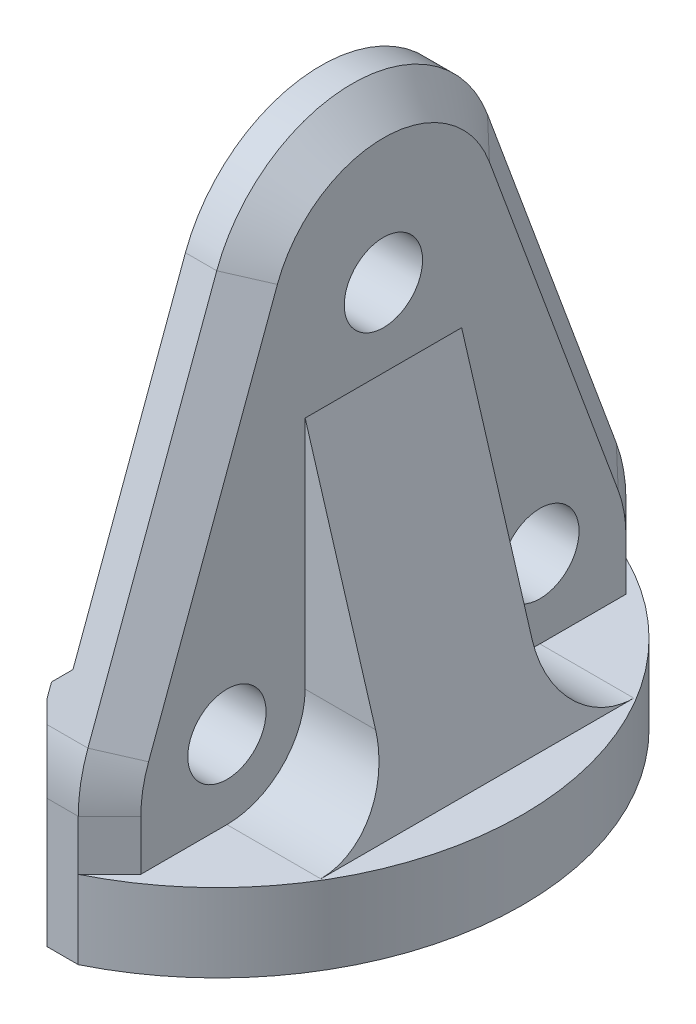
ISO-10303-21;
HEADER;
FILE_DESCRIPTION(('STEP AP214'),'2;1');
FILE_NAME('part.step','',(''),(''),'','','');
FILE_SCHEMA(('AUTOMOTIVE_DESIGN { 1 0 10303 214 1 1 1 1 }'));
ENDSEC;
DATA;
#1=APPLICATION_CONTEXT('core data for automotive mechanical design processes');
#2=APPLICATION_PROTOCOL_DEFINITION('international standard','automotive_design',2000,#1);
#3=PRODUCT_CONTEXT('',#1,'mechanical');
#4=PRODUCT('Part','Part','',(#3));
#5=PRODUCT_RELATED_PRODUCT_CATEGORY('part','',(#4));
#6=PRODUCT_DEFINITION_FORMATION('','',#4);
#7=PRODUCT_DEFINITION_CONTEXT('part definition',#1,'design');
#8=PRODUCT_DEFINITION('design','',#6,#7);
#9=PRODUCT_DEFINITION_SHAPE('','',#8);
#10=(LENGTH_UNIT() NAMED_UNIT(*) SI_UNIT(.MILLI.,.METRE.));
#11=(NAMED_UNIT(*) PLANE_ANGLE_UNIT() SI_UNIT($,.RADIAN.));
#12=(NAMED_UNIT(*) SI_UNIT($,.STERADIAN.) SOLID_ANGLE_UNIT());
#13=UNCERTAINTY_MEASURE_WITH_UNIT(LENGTH_MEASURE(1.E-05),#10,'distance_accuracy_value','');
#14=(GEOMETRIC_REPRESENTATION_CONTEXT(3) GLOBAL_UNCERTAINTY_ASSIGNED_CONTEXT((#13)) GLOBAL_UNIT_ASSIGNED_CONTEXT((#10,
#11,#12)) REPRESENTATION_CONTEXT('',''));
#15=CARTESIAN_POINT('',(0.,0.,0.));
#16=DIRECTION('',(0.,0.,1.));
#17=DIRECTION('',(1.,0.,0.));
#18=AXIS2_PLACEMENT_3D('',#15,#16,#17);
#19=CARTESIAN_POINT('',(4.,30.781,-17.5));
#20=DIRECTION('',(1.,0.,0.));
#21=DIRECTION('',(0.,0.,-1.));
#22=AXIS2_PLACEMENT_3D('',#19,#20,#21);
#23=PLANE('',#22);
#24=CARTESIAN_POINT('',(4.,29.999,-17.5));
#25=DIRECTION('',(1.,0.,0.));
#26=DIRECTION('',(0.,0.,-1.));
#27=AXIS2_PLACEMENT_3D('',#24,#25,#26);
#28=CIRCLE('',#27,2.5);
#29=CARTESIAN_POINT('',(4.,29.999,-20.));
#30=VERTEX_POINT('',#29);
#31=EDGE_CURVE('E269',#30,#30,#28,.T.);
#32=ORIENTED_EDGE('',*,*,#31,.F.);
#33=EDGE_LOOP('',(#32));
#34=FACE_BOUND('',#33,.T.);
#35=CARTESIAN_POINT('',(4.,10.,-7.50000000000001));
#36=DIRECTION('',(1.,0.,0.));
#37=DIRECTION('',(0.,0.,-1.));
#38=AXIS2_PLACEMENT_3D('',#35,#36,#37);
#39=CIRCLE('',#38,2.5);
#40=CARTESIAN_POINT('',(4.,10.,-10.));
#41=VERTEX_POINT('',#40);
#42=EDGE_CURVE('E273',#41,#41,#39,.T.);
#43=ORIENTED_EDGE('',*,*,#42,.F.);
#44=EDGE_LOOP('',(#43));
#45=FACE_BOUND('',#44,.T.);
#46=CARTESIAN_POINT('',(4.,10.,-27.5));
#47=DIRECTION('',(1.,0.,0.));
#48=DIRECTION('',(0.,0.,-1.));
#49=AXIS2_PLACEMENT_3D('',#46,#47,#48);
#50=CIRCLE('',#49,2.5);
#51=CARTESIAN_POINT('',(4.,10.,-30.));
#52=VERTEX_POINT('',#51);
#53=EDGE_CURVE('E279',#52,#52,#50,.T.);
#54=ORIENTED_EDGE('',*,*,#53,.F.);
#55=EDGE_LOOP('',(#54));
#56=FACE_BOUND('',#55,.T.);
#57=DIRECTION('',(0.,0.,-1.));
#58=VECTOR('',#57,1.);
#59=CARTESIAN_POINT('',(4.,5.,-17.5));
#60=LINE('',#59,#58);
#61=CARTESIAN_POINT('',(4.,5.,-2.00000000000001));
#62=VERTEX_POINT('',#61);
#63=CARTESIAN_POINT('',(4.,5.,-7.5));
#64=VERTEX_POINT('',#63);
#65=EDGE_CURVE('E397',#62,#64,#60,.T.);
#66=ORIENTED_EDGE('',*,*,#65,.T.);
#67=CARTESIAN_POINT('',(4.,10.,-7.5));
#68=DIRECTION('',(1.,0.,0.));
#69=DIRECTION('',(0.,0.,-1.));
#70=AXIS2_PLACEMENT_3D('',#67,#68,#69);
#71=CIRCLE('',#70,5.);
#72=CARTESIAN_POINT('',(4.,10.,-12.5));
#73=VERTEX_POINT('',#72);
#74=EDGE_CURVE('E443',#64,#73,#71,.T.);
#75=ORIENTED_EDGE('',*,*,#74,.T.);
#76=DIRECTION('',(0.,1.,0.));
#77=VECTOR('',#76,1.);
#78=CARTESIAN_POINT('',(4.,5.,-12.5));
#79=LINE('',#78,#77);
#80=CARTESIAN_POINT('',(4.,25.,-12.5));
#81=VERTEX_POINT('',#80);
#82=EDGE_CURVE('E253',#73,#81,#79,.T.);
#83=ORIENTED_EDGE('',*,*,#82,.T.);
#84=DIRECTION('',(0.,0.,-1.));
#85=VECTOR('',#84,1.);
#86=CARTESIAN_POINT('',(4.,25.,-12.5));
#87=LINE('',#86,#85);
#88=CARTESIAN_POINT('',(4.,25.,-22.5));
#89=VERTEX_POINT('',#88);
#90=EDGE_CURVE('E259',#81,#89,#87,.T.);
#91=ORIENTED_EDGE('',*,*,#90,.T.);
#92=DIRECTION('',(0.,1.,0.));
#93=VECTOR('',#92,1.);
#94=CARTESIAN_POINT('',(4.,5.,-22.5));
#95=LINE('',#94,#93);
#96=CARTESIAN_POINT('',(4.,10.,-22.5));
#97=VERTEX_POINT('',#96);
#98=EDGE_CURVE('E249',#97,#89,#95,.T.);
#99=ORIENTED_EDGE('',*,*,#98,.F.);
#100=CARTESIAN_POINT('',(4.,10.,-27.5));
#101=DIRECTION('',(1.,0.,0.));
#102=DIRECTION('',(0.,0.,-1.));
#103=AXIS2_PLACEMENT_3D('',#100,#101,#102);
#104=CIRCLE('',#103,5.);
#105=CARTESIAN_POINT('',(4.,5.,-27.5));
#106=VERTEX_POINT('',#105);
#107=EDGE_CURVE('E441',#97,#106,#104,.T.);
#108=ORIENTED_EDGE('',*,*,#107,.T.);
#109=CARTESIAN_POINT('',(4.,5.,-33.));
#110=VERTEX_POINT('',#109);
#111=EDGE_CURVE('E396',#106,#110,#60,.T.);
#112=ORIENTED_EDGE('',*,*,#111,.T.);
#113=DIRECTION('',(0.,-1.,0.));
#114=VECTOR('',#113,1.);
#115=CARTESIAN_POINT('',(4.,0.,-33.));
#116=LINE('',#115,#114);
#117=CARTESIAN_POINT('',(4.,8.213,-33.));
#118=VERTEX_POINT('',#117);
#119=EDGE_CURVE('E332',#110,#118,#116,.F.);
#120=ORIENTED_EDGE('',*,*,#119,.T.);
#121=CARTESIAN_POINT('',(4.,8.213,-25.));
#122=DIRECTION('',(1.,0.,0.));
#123=DIRECTION('',(0.,0.,-1.));
#124=AXIS2_PLACEMENT_3D('',#121,#122,#123);
#125=CIRCLE('',#124,7.99999999999999);
#126=CARTESIAN_POINT('',(4.,10.9832832619337,-32.5050336873761));
#127=VERTEX_POINT('',#126);
#128=EDGE_CURVE('E334',#118,#127,#125,.T.);
#129=ORIENTED_EDGE('',*,*,#128,.T.);
#130=DIRECTION('',(0.,-0.93812921092201,-0.346285407741717));
#131=VECTOR('',#130,1.);
#132=CARTESIAN_POINT('',(4.,10.9832832619337,-32.5050336873761));
#133=LINE('',#132,#131);
#134=CARTESIAN_POINT('',(4.,33.2815269293029,-24.2742310320678));
#135=VERTEX_POINT('',#134);
#136=EDGE_CURVE('E313',#127,#135,#133,.F.);
#137=ORIENTED_EDGE('',*,*,#136,.T.);
#138=CARTESIAN_POINT('',(4.,30.781,-17.5));
#139=DIRECTION('',(1.,0.,0.));
#140=DIRECTION('',(0.,0.,-1.));
#141=AXIS2_PLACEMENT_3D('',#138,#139,#140);
#142=CIRCLE('',#141,7.221);
#143=CARTESIAN_POINT('',(4.,33.2812308832856,-10.7256596977813));
#144=VERTEX_POINT('',#143);
#145=EDGE_CURVE('E304',#135,#144,#142,.T.);
#146=ORIENTED_EDGE('',*,*,#145,.T.);
#147=DIRECTION('',(0.,0.938144343196055,-0.346244409816597));
#148=VECTOR('',#147,1.);
#149=CARTESIAN_POINT('',(4.,33.2812308832856,-10.7256596977813));
#150=LINE('',#149,#148);
#151=CARTESIAN_POINT('',(4.,10.9799552785328,-2.49484525443157));
#152=VERTEX_POINT('',#151);
#153=EDGE_CURVE('E325',#144,#152,#150,.F.);
#154=ORIENTED_EDGE('',*,*,#153,.T.);
#155=CARTESIAN_POINT('',(4.,8.21,-10.));
#156=DIRECTION('',(1.,0.,0.));
#157=DIRECTION('',(0.,0.,-1.));
#158=AXIS2_PLACEMENT_3D('',#155,#156,#157);
#159=CIRCLE('',#158,7.99999999999999);
#160=CARTESIAN_POINT('',(4.,8.21,-2.00000000000001));
#161=VERTEX_POINT('',#160);
#162=EDGE_CURVE('E327',#152,#161,#159,.T.);
#163=ORIENTED_EDGE('',*,*,#162,.T.);
#164=DIRECTION('',(0.,1.,0.));
#165=VECTOR('',#164,1.);
#166=CARTESIAN_POINT('',(4.,8.21,-2.00000000000001));
#167=LINE('',#166,#165);
#168=EDGE_CURVE('E329',#161,#62,#167,.F.);
#169=ORIENTED_EDGE('',*,*,#168,.T.);
#170=EDGE_LOOP('',(#66,#75,#83,#91,#99,#108,#112,#120,#129,#137,#146,#154,#163,#169));
#171=FACE_BOUND('',#170,.T.);
#172=ADVANCED_FACE('F33',(#34,#45,#56,#171),#23,.T.);
#173=CARTESIAN_POINT('',(-6.60232526704262,5.,-17.5));
#174=DIRECTION('',(0.,-1.,0.));
#175=DIRECTION('',(0.,0.,-1.));
#176=AXIS2_PLACEMENT_3D('',#173,#174,#175);
#177=PLANE('',#176);
#178=DIRECTION('',(0.,0.,-1.));
#179=VECTOR('',#178,1.);
#180=CARTESIAN_POINT('',(10.,5.,-12.5));
#181=LINE('',#180,#179);
#182=CARTESIAN_POINT('',(10.,5.,-7.5));
#183=VERTEX_POINT('',#182);
#184=CARTESIAN_POINT('',(10.,5.,-27.5));
#185=VERTEX_POINT('',#184);
#186=EDGE_CURVE('E262',#183,#185,#181,.T.);
#187=ORIENTED_EDGE('',*,*,#186,.F.);
#188=DIRECTION('',(-1.,0.,0.));
#189=VECTOR('',#188,1.);
#190=CARTESIAN_POINT('',(4.,5.,-7.5));
#191=LINE('',#190,#189);
#192=EDGE_CURVE('E438',#183,#64,#191,.T.);
#193=ORIENTED_EDGE('',*,*,#192,.T.);
#194=ORIENTED_EDGE('',*,*,#65,.F.);
#195=DIRECTION('',(0.707106781186546,0.,-0.707106781186549));
#196=VECTOR('',#195,1.);
#197=CARTESIAN_POINT('',(2.,5.,0.));
#198=LINE('',#197,#196);
#199=CARTESIAN_POINT('',(2.,5.,0.));
#200=VERTEX_POINT('',#199);
#201=EDGE_CURVE('E302',#62,#200,#198,.F.);
#202=ORIENTED_EDGE('',*,*,#201,.T.);
#203=CARTESIAN_POINT('',(-6.60232526704262,5.,-17.5));
#204=DIRECTION('',(0.,-1.,0.));
#205=DIRECTION('',(0.,0.,-1.));
#206=AXIS2_PLACEMENT_3D('',#203,#204,#205);
#207=CIRCLE('',#206,19.5);
#208=CARTESIAN_POINT('',(2.,5.,-35.));
#209=VERTEX_POINT('',#208);
#210=EDGE_CURVE('E294',#209,#200,#207,.T.);
#211=ORIENTED_EDGE('',*,*,#210,.F.);
#212=DIRECTION('',(-0.707106781186546,0.,-0.707106781186549));
#213=VECTOR('',#212,1.);
#214=CARTESIAN_POINT('',(2.,5.,-35.));
#215=LINE('',#214,#213);
#216=EDGE_CURVE('E297',#209,#110,#215,.F.);
#217=ORIENTED_EDGE('',*,*,#216,.T.);
#218=ORIENTED_EDGE('',*,*,#111,.F.);
#219=DIRECTION('',(-1.,0.,0.));
#220=VECTOR('',#219,1.);
#221=CARTESIAN_POINT('',(-6.60232526704262,5.,-27.5));
#222=LINE('',#221,#220);
#223=EDGE_CURVE('E433',#106,#185,#222,.F.);
#224=ORIENTED_EDGE('',*,*,#223,.T.);
#225=EDGE_LOOP('',(#187,#193,#194,#202,#211,#217,#218,#224));
#226=FACE_BOUND('',#225,.T.);
#227=ADVANCED_FACE('F459',(#226),#177,.F.);
#228=CARTESIAN_POINT('',(0.,30.781,-17.5));
#229=DIRECTION('',(1.,0.,0.));
#230=DIRECTION('',(0.,0.,-1.));
#231=AXIS2_PLACEMENT_3D('',#228,#229,#230);
#232=PLANE('',#231);
#233=DIRECTION('',(0.,0.,1.));
#234=VECTOR('',#233,1.);
#235=CARTESIAN_POINT('',(0.,2.,-20.5));
#236=LINE('',#235,#234);
#237=CARTESIAN_POINT('',(0.,2.,-20.5));
#238=VERTEX_POINT('',#237);
#239=CARTESIAN_POINT('',(0.,2.,-14.5));
#240=VERTEX_POINT('',#239);
#241=EDGE_CURVE('E243',#238,#240,#236,.T.);
#242=ORIENTED_EDGE('',*,*,#241,.F.);
#243=DIRECTION('',(0.,-1.,0.));
#244=VECTOR('',#243,1.);
#245=CARTESIAN_POINT('',(0.,5.,-20.5));
#246=LINE('',#245,#244);
#247=CARTESIAN_POINT('',(0.,5.,-20.5));
#248=VERTEX_POINT('',#247);
#249=EDGE_CURVE('E48',#248,#238,#246,.T.);
#250=ORIENTED_EDGE('',*,*,#249,.F.);
#251=DIRECTION('',(0.,0.,-1.));
#252=VECTOR('',#251,1.);
#253=CARTESIAN_POINT('',(0.,5.,-20.5));
#254=LINE('',#253,#252);
#255=CARTESIAN_POINT('',(0.,5.,-14.5));
#256=VERTEX_POINT('',#255);
#257=EDGE_CURVE('E231',#256,#248,#254,.T.);
#258=ORIENTED_EDGE('',*,*,#257,.F.);
#259=DIRECTION('',(0.,1.,0.));
#260=VECTOR('',#259,1.);
#261=CARTESIAN_POINT('',(0.,5.,-14.5));
#262=LINE('',#261,#260);
#263=EDGE_CURVE('E234',#240,#256,#262,.T.);
#264=ORIENTED_EDGE('',*,*,#263,.F.);
#265=EDGE_LOOP('',(#242,#250,#258,#264));
#266=FACE_BOUND('',#265,.T.);
#267=DIRECTION('',(0.,0.,1.));
#268=VECTOR('',#267,1.);
#269=CARTESIAN_POINT('',(0.,5.5,-35.));
#270=LINE('',#269,#268);
#271=CARTESIAN_POINT('',(0.,5.5,-35.));
#272=VERTEX_POINT('',#271);
#273=CARTESIAN_POINT('',(0.,5.5,0.));
#274=VERTEX_POINT('',#273);
#275=EDGE_CURVE('E286',#272,#274,#270,.T.);
#276=ORIENTED_EDGE('',*,*,#275,.F.);
#277=DIRECTION('',(0.,1.,0.));
#278=VECTOR('',#277,1.);
#279=CARTESIAN_POINT('',(0.,0.,-35.));
#280=LINE('',#279,#278);
#281=CARTESIAN_POINT('',(0.,0.,-35.));
#282=VERTEX_POINT('',#281);
#283=EDGE_CURVE('E370',#282,#272,#280,.T.);
#284=ORIENTED_EDGE('',*,*,#283,.F.);
#285=DIRECTION('',(0.,0.,-1.));
#286=VECTOR('',#285,1.);
#287=CARTESIAN_POINT('',(0.,0.,0.));
#288=LINE('',#287,#286);
#289=CARTESIAN_POINT('',(0.,0.,0.));
#290=VERTEX_POINT('',#289);
#291=EDGE_CURVE('E368',#290,#282,#288,.T.);
#292=ORIENTED_EDGE('',*,*,#291,.F.);
#293=DIRECTION('',(0.,1.,0.));
#294=VECTOR('',#293,1.);
#295=CARTESIAN_POINT('',(0.,0.,0.));
#296=LINE('',#295,#294);
#297=EDGE_CURVE('E365',#290,#274,#296,.T.);
#298=ORIENTED_EDGE('',*,*,#297,.T.);
#299=EDGE_LOOP('',(#276,#284,#292,#298));
#300=FACE_BOUND('',#299,.T.);
#301=ADVANCED_FACE('F519',(#266,#300),#232,.F.);
#302=CARTESIAN_POINT('',(0.,29.999,-17.5));
#303=DIRECTION('',(-1.,0.,0.));
#304=DIRECTION('',(0.,0.,1.));
#305=AXIS2_PLACEMENT_3D('',#302,#303,#304);
#306=CIRCLE('',#305,2.5);
#307=CARTESIAN_POINT('',(0.,29.999,-15.));
#308=VERTEX_POINT('',#307);
#309=EDGE_CURVE('E264',#308,#308,#306,.T.);
#310=ORIENTED_EDGE('',*,*,#309,.F.);
#311=EDGE_LOOP('',(#310));
#312=FACE_BOUND('',#311,.T.);
#313=DIRECTION('',(0.,0.,-1.));
#314=VECTOR('',#313,1.);
#315=CARTESIAN_POINT('',(0.,14.5,-33.3388338732565));
#316=LINE('',#315,#314);
#317=CARTESIAN_POINT('',(0.,14.5,-1.66213310458673));
#318=VERTEX_POINT('',#317);
#319=CARTESIAN_POINT('',(0.,14.5,-33.3388338732565));
#320=VERTEX_POINT('',#319);
#321=EDGE_CURVE('E282',#318,#320,#316,.T.);
#322=ORIENTED_EDGE('',*,*,#321,.F.);
#323=DIRECTION('',(0.,-0.938144343196055,0.346244409816597));
#324=VECTOR('',#323,1.);
#325=CARTESIAN_POINT('',(0.,33.9737197029188,-8.84937101138918));
#326=LINE('',#325,#324);
#327=CARTESIAN_POINT('',(0.,33.9737197029188,-8.84937101138918));
#328=VERTEX_POINT('',#327);
#329=EDGE_CURVE('E362',#328,#318,#326,.T.);
#330=ORIENTED_EDGE('',*,*,#329,.F.);
#331=CARTESIAN_POINT('',(0.,30.781,-17.5));
#332=DIRECTION('',(1.,0.,0.));
#333=DIRECTION('',(0.,0.,-1.));
#334=AXIS2_PLACEMENT_3D('',#331,#332,#333);
#335=CIRCLE('',#334,9.221);
#336=CARTESIAN_POINT('',(0.,33.9740977447864,-26.1504894539119));
#337=VERTEX_POINT('',#336);
#338=EDGE_CURVE('E307',#337,#328,#335,.T.);
#339=ORIENTED_EDGE('',*,*,#338,.F.);
#340=DIRECTION('',(0.,-0.93812921092201,-0.346285407741717));
#341=VECTOR('',#340,1.);
#342=CARTESIAN_POINT('',(0.,33.9740977447864,-26.1504894539119));
#343=LINE('',#342,#341);
#344=EDGE_CURVE('E341',#337,#320,#343,.T.);
#345=ORIENTED_EDGE('',*,*,#344,.T.);
#346=EDGE_LOOP('',(#322,#330,#339,#345));
#347=FACE_BOUND('',#346,.T.);
#348=ADVANCED_FACE('F543',(#312,#347),#232,.F.);
#349=CARTESIAN_POINT('',(2.,8.21,0.));
#350=DIRECTION('',(0.707106781186549,0.,0.707106781186546));
#351=DIRECTION('',(0.707106781186546,0.,-0.707106781186549));
#352=AXIS2_PLACEMENT_3D('',#349,#350,#351);
#353=PLANE('',#352);
#354=ORIENTED_EDGE('',*,*,#201,.F.);
#355=ORIENTED_EDGE('',*,*,#168,.F.);
#356=DIRECTION('',(-0.707106781186546,0.,0.707106781186549));
#357=VECTOR('',#356,1.);
#358=CARTESIAN_POINT('',(2.,8.21,0.));
#359=LINE('',#358,#357);
#360=CARTESIAN_POINT('',(2.,8.21,0.));
#361=VERTEX_POINT('',#360);
#362=EDGE_CURVE('E318',#161,#361,#359,.T.);
#363=ORIENTED_EDGE('',*,*,#362,.T.);
#364=DIRECTION('',(0.,1.,0.));
#365=VECTOR('',#364,1.);
#366=CARTESIAN_POINT('',(2.,0.,0.));
#367=LINE('',#366,#365);
#368=EDGE_CURVE('E346',#200,#361,#367,.T.);
#369=ORIENTED_EDGE('',*,*,#368,.F.);
#370=EDGE_LOOP('',(#354,#355,#363,#369));
#371=FACE_BOUND('',#370,.T.);
#372=ADVANCED_FACE('F467',(#371),#353,.T.);
#373=CARTESIAN_POINT('',(2.,0.,-35.));
#374=DIRECTION('',(0.707106781186549,0.,-0.707106781186546));
#375=DIRECTION('',(-0.707106781186546,0.,-0.707106781186549));
#376=AXIS2_PLACEMENT_3D('',#373,#374,#375);
#377=PLANE('',#376);
#378=ORIENTED_EDGE('',*,*,#216,.F.);
#379=DIRECTION('',(0.,1.,0.));
#380=VECTOR('',#379,1.);
#381=CARTESIAN_POINT('',(2.,0.,-35.));
#382=LINE('',#381,#380);
#383=CARTESIAN_POINT('',(2.,8.213,-35.));
#384=VERTEX_POINT('',#383);
#385=EDGE_CURVE('E350',#209,#384,#382,.T.);
#386=ORIENTED_EDGE('',*,*,#385,.T.);
#387=DIRECTION('',(-0.707106781186546,0.,-0.707106781186549));
#388=VECTOR('',#387,1.);
#389=CARTESIAN_POINT('',(2.,8.213,-35.));
#390=LINE('',#389,#388);
#391=EDGE_CURVE('E315',#118,#384,#390,.T.);
#392=ORIENTED_EDGE('',*,*,#391,.F.);
#393=ORIENTED_EDGE('',*,*,#119,.F.);
#394=EDGE_LOOP('',(#378,#386,#392,#393));
#395=FACE_BOUND('',#394,.T.);
#396=ADVANCED_FACE('F484',(#395),#377,.T.);
#397=CARTESIAN_POINT('',(2.,30.781,-17.5));
#398=DIRECTION('',(-1.,0.,0.));
#399=DIRECTION('',(0.,0.,1.));
#400=AXIS2_PLACEMENT_3D('',#397,#398,#399);
#401=CYLINDRICAL_SURFACE('',#400,9.221);
#402=ORIENTED_EDGE('',*,*,#338,.T.);
#403=DIRECTION('',(-1.,0.,0.));
#404=VECTOR('',#403,1.);
#405=CARTESIAN_POINT('',(2.,33.9737197029188,-8.84937101138918));
#406=LINE('',#405,#404);
#407=CARTESIAN_POINT('',(2.,33.9737197029188,-8.84937101138918));
#408=VERTEX_POINT('',#407);
#409=EDGE_CURVE('E393',#408,#328,#406,.T.);
#410=ORIENTED_EDGE('',*,*,#409,.F.);
#411=CARTESIAN_POINT('',(2.,30.781,-17.5));
#412=DIRECTION('',(1.,0.,0.));
#413=DIRECTION('',(0.,0.,-1.));
#414=AXIS2_PLACEMENT_3D('',#411,#412,#413);
#415=CIRCLE('',#414,9.221);
#416=CARTESIAN_POINT('',(2.,33.9740977447864,-26.1504894539119));
#417=VERTEX_POINT('',#416);
#418=EDGE_CURVE('E337',#417,#408,#415,.T.);
#419=ORIENTED_EDGE('',*,*,#418,.F.);
#420=DIRECTION('',(-1.,0.,0.));
#421=VECTOR('',#420,1.);
#422=CARTESIAN_POINT('',(2.,33.9740977447864,-26.1504894539119));
#423=LINE('',#422,#421);
#424=EDGE_CURVE('E359',#417,#337,#423,.T.);
#425=ORIENTED_EDGE('',*,*,#424,.T.);
#426=EDGE_LOOP('',(#402,#410,#419,#425));
#427=FACE_BOUND('',#426,.T.);
#428=ADVANCED_FACE('F540',(#427),#401,.T.);
#429=CARTESIAN_POINT('',(2.,33.9737197029188,-8.84937101138918));
#430=DIRECTION('',(0.,-0.346244409816597,-0.938144343196055));
#431=DIRECTION('',(0.,0.938144343196055,-0.346244409816597));
#432=AXIS2_PLACEMENT_3D('',#429,#430,#431);
#433=PLANE('',#432);
#434=DIRECTION('',(0.,0.938144343196055,-0.346244409816596));
#435=VECTOR('',#434,1.);
#436=CARTESIAN_POINT('',(-1.,14.5,-1.66213310458673));
#437=LINE('',#436,#435);
#438=CARTESIAN_POINT('',(-1.,12.705959695234,-1.00000000000001));
#439=VERTEX_POINT('',#438);
#440=CARTESIAN_POINT('',(-1.,13.5,-1.29305939825598));
#441=VERTEX_POINT('',#440);
#442=EDGE_CURVE('E283',#439,#441,#437,.T.);
#443=ORIENTED_EDGE('',*,*,#442,.F.);
#444=DIRECTION('',(-0.327186984751048,0.886508518864335,-0.327186984751045));
#445=VECTOR('',#444,1.);
#446=CARTESIAN_POINT('',(0.304071314837481,9.17259686697337,0.304071314837464));
#447=LINE('',#446,#445);
#448=CARTESIAN_POINT('',(-0.618556568039445,11.672444098166,-0.618556568039455));
#449=VERTEX_POINT('',#448);
#450=EDGE_CURVE('E417',#439,#449,#447,.F.);
#451=ORIENTED_EDGE('',*,*,#450,.T.);
#452=DIRECTION('',(-1.,0.,0.));
#453=VECTOR('',#452,1.);
#454=CARTESIAN_POINT('',(2.,11.672444098166,-0.618556568039455));
#455=LINE('',#454,#453);
#456=CARTESIAN_POINT('',(2.,11.672444098166,-0.618556568039455));
#457=VERTEX_POINT('',#456);
#458=EDGE_CURVE('E390',#457,#449,#455,.T.);
#459=ORIENTED_EDGE('',*,*,#458,.F.);
#460=DIRECTION('',(0.,-0.938144343196055,0.346244409816597));
#461=VECTOR('',#460,1.);
#462=CARTESIAN_POINT('',(2.,33.9737197029188,-8.84937101138918));
#463=LINE('',#462,#461);
#464=EDGE_CURVE('E340',#408,#457,#463,.T.);
#465=ORIENTED_EDGE('',*,*,#464,.F.);
#466=ORIENTED_EDGE('',*,*,#409,.T.);
#467=ORIENTED_EDGE('',*,*,#329,.T.);
#468=DIRECTION('',(-0.684191192294359,-0.684191192294354,0.252516979178933));
#469=VECTOR('',#468,1.);
#470=CARTESIAN_POINT('',(0.504297196634417,15.0042971966344,-1.8482559400408));
#471=LINE('',#470,#469);
#472=EDGE_CURVE('E408',#318,#441,#471,.T.);
#473=ORIENTED_EDGE('',*,*,#472,.T.);
#474=EDGE_LOOP('',(#443,#451,#459,#465,#466,#467,#473));
#475=FACE_BOUND('',#474,.T.);
#476=ADVANCED_FACE('F573',(#475),#433,.F.);
#477=CARTESIAN_POINT('',(2.,8.21,-10.));
#478=DIRECTION('',(-1.,0.,0.));
#479=DIRECTION('',(0.,0.,1.));
#480=AXIS2_PLACEMENT_3D('',#477,#478,#479);
#481=CYLINDRICAL_SURFACE('',#480,10.);
#482=ORIENTED_EDGE('',*,*,#458,.T.);
#483=CARTESIAN_POINT('',(-10.0000000000001,8.21,-10.));
#484=DIRECTION('',(0.707106781186545,0.,-0.70710678118655));
#485=DIRECTION('',(-0.70710678118655,0.,-0.707106781186545));
#486=AXIS2_PLACEMENT_3D('',#483,#484,#485);
#487=ELLIPSE('',#486,14.142135623731,10.);
#488=CARTESIAN_POINT('',(0.,8.21,0.));
#489=VERTEX_POINT('',#488);
#490=EDGE_CURVE('E419',#449,#489,#487,.T.);
#491=ORIENTED_EDGE('',*,*,#490,.T.);
#492=DIRECTION('',(-1.,0.,0.));
#493=VECTOR('',#492,1.);
#494=CARTESIAN_POINT('',(2.,8.21,0.));
#495=LINE('',#494,#493);
#496=EDGE_CURVE('E387',#361,#489,#495,.T.);
#497=ORIENTED_EDGE('',*,*,#496,.F.);
#498=CARTESIAN_POINT('',(2.,8.21,-10.));
#499=DIRECTION('',(1.,0.,0.));
#500=DIRECTION('',(0.,0.,-1.));
#501=AXIS2_PLACEMENT_3D('',#498,#499,#500);
#502=CIRCLE('',#501,10.);
#503=EDGE_CURVE('E343',#457,#361,#502,.T.);
#504=ORIENTED_EDGE('',*,*,#503,.F.);
#505=EDGE_LOOP('',(#482,#491,#497,#504));
#506=FACE_BOUND('',#505,.T.);
#507=ADVANCED_FACE('F569',(#506),#481,.T.);
#508=CARTESIAN_POINT('',(2.,0.,0.));
#509=DIRECTION('',(0.,0.,1.));
#510=DIRECTION('',(1.,0.,0.));
#511=AXIS2_PLACEMENT_3D('',#508,#509,#510);
#512=PLANE('',#511);
#513=ORIENTED_EDGE('',*,*,#496,.T.);
#514=DIRECTION('',(0.,-1.,0.));
#515=VECTOR('',#514,1.);
#516=CARTESIAN_POINT('',(0.,0.,0.));
#517=LINE('',#516,#515);
#518=EDGE_CURVE('E421',#489,#274,#517,.T.);
#519=ORIENTED_EDGE('',*,*,#518,.T.);
#520=ORIENTED_EDGE('',*,*,#297,.F.);
#521=DIRECTION('',(-1.,0.,0.));
#522=VECTOR('',#521,1.);
#523=CARTESIAN_POINT('',(2.,0.,0.));
#524=LINE('',#523,#522);
#525=CARTESIAN_POINT('',(2.,0.,0.));
#526=VERTEX_POINT('',#525);
#527=EDGE_CURVE('E385',#526,#290,#524,.T.);
#528=ORIENTED_EDGE('',*,*,#527,.F.);
#529=EDGE_CURVE('E347',#526,#200,#367,.T.);
#530=ORIENTED_EDGE('',*,*,#529,.T.);
#531=ORIENTED_EDGE('',*,*,#368,.T.);
#532=EDGE_LOOP('',(#513,#519,#520,#528,#530,#531));
#533=FACE_BOUND('',#532,.T.);
#534=ADVANCED_FACE('F565',(#533),#512,.T.);
#535=CARTESIAN_POINT('',(2.,0.,0.));
#536=DIRECTION('',(0.,1.,0.));
#537=DIRECTION('',(0.,0.,1.));
#538=AXIS2_PLACEMENT_3D('',#535,#536,#537);
#539=PLANE('',#538);
#540=CARTESIAN_POINT('',(5.,0.,-17.5));
#541=DIRECTION('',(0.,-1.,0.));
#542=DIRECTION('',(0.,0.,-1.));
#543=AXIS2_PLACEMENT_3D('',#540,#541,#542);
#544=CIRCLE('',#543,1.7);
#545=CARTESIAN_POINT('',(5.,0.,-19.2));
#546=VERTEX_POINT('',#545);
#547=EDGE_CURVE('E237',#546,#546,#544,.T.);
#548=ORIENTED_EDGE('',*,*,#547,.F.);
#549=EDGE_LOOP('',(#548));
#550=FACE_BOUND('',#549,.T.);
#551=ORIENTED_EDGE('',*,*,#291,.T.);
#552=DIRECTION('',(-1.,0.,0.));
#553=VECTOR('',#552,1.);
#554=CARTESIAN_POINT('',(2.,0.,-35.));
#555=LINE('',#554,#553);
#556=CARTESIAN_POINT('',(2.,0.,-35.));
#557=VERTEX_POINT('',#556);
#558=EDGE_CURVE('E382',#557,#282,#555,.T.);
#559=ORIENTED_EDGE('',*,*,#558,.F.);
#560=CARTESIAN_POINT('',(-6.60232526704262,0.,-17.5));
#561=DIRECTION('',(0.,-1.,0.));
#562=DIRECTION('',(0.,0.,-1.));
#563=AXIS2_PLACEMENT_3D('',#560,#561,#562);
#564=CIRCLE('',#563,19.5);
#565=EDGE_CURVE('E289',#557,#526,#564,.T.);
#566=ORIENTED_EDGE('',*,*,#565,.T.);
#567=ORIENTED_EDGE('',*,*,#527,.T.);
#568=EDGE_LOOP('',(#551,#559,#566,#567));
#569=FACE_BOUND('',#568,.T.);
#570=ADVANCED_FACE('F562',(#550,#569),#539,.F.);
#571=CARTESIAN_POINT('',(2.,0.,-35.));
#572=DIRECTION('',(0.,0.,1.));
#573=DIRECTION('',(1.,0.,0.));
#574=AXIS2_PLACEMENT_3D('',#571,#572,#573);
#575=PLANE('',#574);
#576=ORIENTED_EDGE('',*,*,#283,.T.);
#577=DIRECTION('',(0.,1.,0.));
#578=VECTOR('',#577,1.);
#579=CARTESIAN_POINT('',(0.,8.213,-35.));
#580=LINE('',#579,#578);
#581=CARTESIAN_POINT('',(0.,8.213,-35.));
#582=VERTEX_POINT('',#581);
#583=EDGE_CURVE('E427',#272,#582,#580,.T.);
#584=ORIENTED_EDGE('',*,*,#583,.T.);
#585=DIRECTION('',(-1.,0.,0.));
#586=VECTOR('',#585,1.);
#587=CARTESIAN_POINT('',(2.,8.213,-35.));
#588=LINE('',#587,#586);
#589=EDGE_CURVE('E379',#384,#582,#588,.T.);
#590=ORIENTED_EDGE('',*,*,#589,.F.);
#591=ORIENTED_EDGE('',*,*,#385,.F.);
#592=EDGE_CURVE('E351',#557,#209,#382,.T.);
#593=ORIENTED_EDGE('',*,*,#592,.F.);
#594=ORIENTED_EDGE('',*,*,#558,.T.);
#595=EDGE_LOOP('',(#576,#584,#590,#591,#593,#594));
#596=FACE_BOUND('',#595,.T.);
#597=ADVANCED_FACE('F478',(#596),#575,.F.);
#598=CARTESIAN_POINT('',(2.,8.213,-25.));
#599=DIRECTION('',(-1.,0.,0.));
#600=DIRECTION('',(0.,0.,1.));
#601=AXIS2_PLACEMENT_3D('',#598,#599,#600);
#602=CYLINDRICAL_SURFACE('',#601,10.);
#603=ORIENTED_EDGE('',*,*,#589,.T.);
#604=CARTESIAN_POINT('',(-10.0000000000001,8.213,-25.));
#605=DIRECTION('',(-0.707106781186543,0.,-0.707106781186552));
#606=DIRECTION('',(-0.707106781186552,0.,0.707106781186543));
#607=AXIS2_PLACEMENT_3D('',#604,#605,#606);
#608=ELLIPSE('',#607,14.1421356237311,10.);
#609=CARTESIAN_POINT('',(-0.618707890779912,11.6758540774172,-34.3812921092201));
#610=VERTEX_POINT('',#609);
#611=EDGE_CURVE('E429',#582,#610,#608,.F.);
#612=ORIENTED_EDGE('',*,*,#611,.T.);
#613=DIRECTION('',(-1.,0.,0.));
#614=VECTOR('',#613,1.);
#615=CARTESIAN_POINT('',(2.,11.6758540774172,-34.3812921092201));
#616=LINE('',#615,#614);
#617=CARTESIAN_POINT('',(2.,11.6758540774172,-34.3812921092201));
#618=VERTEX_POINT('',#617);
#619=EDGE_CURVE('E376',#618,#610,#616,.T.);
#620=ORIENTED_EDGE('',*,*,#619,.F.);
#621=CARTESIAN_POINT('',(2.,8.213,-25.));
#622=DIRECTION('',(1.,0.,0.));
#623=DIRECTION('',(0.,0.,-1.));
#624=AXIS2_PLACEMENT_3D('',#621,#622,#623);
#625=CIRCLE('',#624,10.);
#626=EDGE_CURVE('E353',#384,#618,#625,.T.);
#627=ORIENTED_EDGE('',*,*,#626,.F.);
#628=EDGE_LOOP('',(#603,#612,#620,#627));
#629=FACE_BOUND('',#628,.T.);
#630=ADVANCED_FACE('F555',(#629),#602,.T.);
#631=CARTESIAN_POINT('',(2.,33.9740977447864,-26.1504894539119));
#632=DIRECTION('',(0.,0.346285407741717,-0.93812921092201));
#633=DIRECTION('',(0.,0.93812921092201,0.346285407741717));
#634=AXIS2_PLACEMENT_3D('',#631,#632,#633);
#635=PLANE('',#634);
#636=ORIENTED_EDGE('',*,*,#619,.T.);
#637=DIRECTION('',(-0.327221578160517,0.886482982110929,0.327221578160512));
#638=VECTOR('',#637,1.);
#639=CARTESIAN_POINT('',(-7.68781047468706,30.8269112132519,-27.3121895253131));
#640=LINE('',#639,#638);
#641=CARTESIAN_POINT('',(-1.,12.7088206926903,-34.));
#642=VERTEX_POINT('',#641);
#643=EDGE_CURVE('E431',#610,#642,#640,.T.);
#644=ORIENTED_EDGE('',*,*,#643,.T.);
#645=DIRECTION('',(0.,-0.93812921092201,-0.346285407741716));
#646=VECTOR('',#645,1.);
#647=CARTESIAN_POINT('',(-1.,14.5,-33.3388338732565));
#648=LINE('',#647,#646);
#649=CARTESIAN_POINT('',(-1.,13.5,-33.7079572346337));
#650=VERTEX_POINT('',#649);
#651=EDGE_CURVE('E285',#650,#642,#648,.T.);
#652=ORIENTED_EDGE('',*,*,#651,.F.);
#653=DIRECTION('',(0.684185322369236,0.684185322369231,0.252548785997906));
#654=VECTOR('',#653,1.);
#655=CARTESIAN_POINT('',(11.2943056194108,25.7943056194107,-29.1698418185977));
#656=LINE('',#655,#654);
#657=EDGE_CURVE('E406',#650,#320,#656,.T.);
#658=ORIENTED_EDGE('',*,*,#657,.T.);
#659=ORIENTED_EDGE('',*,*,#344,.F.);
#660=ORIENTED_EDGE('',*,*,#424,.F.);
#661=DIRECTION('',(0.,-0.93812921092201,-0.346285407741717));
#662=VECTOR('',#661,1.);
#663=CARTESIAN_POINT('',(2.,33.9740977447864,-26.1504894539119));
#664=LINE('',#663,#662);
#665=EDGE_CURVE('E356',#417,#618,#664,.T.);
#666=ORIENTED_EDGE('',*,*,#665,.T.);
#667=EDGE_LOOP('',(#636,#644,#652,#658,#659,#660,#666));
#668=FACE_BOUND('',#667,.T.);
#669=ADVANCED_FACE('F529',(#668),#635,.T.);
#670=CARTESIAN_POINT('',(2.,30.781,-17.5));
#671=DIRECTION('',(-1.,0.,0.));
#672=DIRECTION('',(0.,0.,-1.));
#673=AXIS2_PLACEMENT_3D('',#670,#671,#672);
#674=CONICAL_SURFACE('',#673,9.221,0.78539816339745);
#675=ORIENTED_EDGE('',*,*,#418,.T.);
#676=DIRECTION('',(-0.707106781186546,0.24483177012925,0.663368226805731));
#677=VECTOR('',#676,1.);
#678=CARTESIAN_POINT('',(2.,33.9737197029188,-8.84937101138918));
#679=LINE('',#678,#677);
#680=EDGE_CURVE('E305',#144,#408,#679,.T.);
#681=ORIENTED_EDGE('',*,*,#680,.F.);
#682=ORIENTED_EDGE('',*,*,#145,.F.);
#683=DIRECTION('',(-0.707106781186546,0.244860760040118,-0.663357526672139));
#684=VECTOR('',#683,1.);
#685=CARTESIAN_POINT('',(2.,33.9740977447864,-26.1504894539119));
#686=LINE('',#685,#684);
#687=EDGE_CURVE('E309',#135,#417,#686,.T.);
#688=ORIENTED_EDGE('',*,*,#687,.T.);
#689=EDGE_LOOP('',(#675,#681,#682,#688));
#690=FACE_BOUND('',#689,.T.);
#691=ADVANCED_FACE('F525',(#690),#674,.T.);
#692=CARTESIAN_POINT('',(2.,33.9737197029188,-8.84937101138918));
#693=DIRECTION('',(0.707106781186549,0.244831770129249,0.663368226805729));
#694=DIRECTION('',(0.684191192294355,0.,-0.729302689139996));
#695=AXIS2_PLACEMENT_3D('',#692,#693,#694);
#696=PLANE('',#695);
#697=ORIENTED_EDGE('',*,*,#464,.T.);
#698=DIRECTION('',(-0.707106781186546,0.24483177012925,0.663368226805731));
#699=VECTOR('',#698,1.);
#700=CARTESIAN_POINT('',(2.,11.672444098166,-0.618556568039453));
#701=LINE('',#700,#699);
#702=EDGE_CURVE('E308',#152,#457,#701,.T.);
#703=ORIENTED_EDGE('',*,*,#702,.F.);
#704=ORIENTED_EDGE('',*,*,#153,.F.);
#705=ORIENTED_EDGE('',*,*,#680,.T.);
#706=EDGE_LOOP('',(#697,#703,#704,#705));
#707=FACE_BOUND('',#706,.T.);
#708=ADVANCED_FACE('F528',(#707),#696,.T.);
#709=CARTESIAN_POINT('',(2.,8.21,-10.));
#710=DIRECTION('',(-1.,0.,0.));
#711=DIRECTION('',(0.,0.,-1.));
#712=AXIS2_PLACEMENT_3D('',#709,#710,#711);
#713=CONICAL_SURFACE('',#712,10.,0.78539816339745);
#714=ORIENTED_EDGE('',*,*,#503,.T.);
#715=ORIENTED_EDGE('',*,*,#362,.F.);
#716=ORIENTED_EDGE('',*,*,#162,.F.);
#717=ORIENTED_EDGE('',*,*,#702,.T.);
#718=EDGE_LOOP('',(#714,#715,#716,#717));
#719=FACE_BOUND('',#718,.T.);
#720=ADVANCED_FACE('F537',(#719),#713,.T.);
#721=CARTESIAN_POINT('',(2.,8.213,-25.));
#722=DIRECTION('',(-1.,0.,0.));
#723=DIRECTION('',(0.,0.,-1.));
#724=AXIS2_PLACEMENT_3D('',#721,#722,#723);
#725=CONICAL_SURFACE('',#724,10.,0.78539816339745);
#726=ORIENTED_EDGE('',*,*,#626,.T.);
#727=DIRECTION('',(-0.707106781186546,0.244860760040117,-0.663357526672139));
#728=VECTOR('',#727,1.);
#729=CARTESIAN_POINT('',(2.,11.6758540774172,-34.3812921092201));
#730=LINE('',#729,#728);
#731=EDGE_CURVE('E312',#127,#618,#730,.T.);
#732=ORIENTED_EDGE('',*,*,#731,.F.);
#733=ORIENTED_EDGE('',*,*,#128,.F.);
#734=ORIENTED_EDGE('',*,*,#391,.T.);
#735=EDGE_LOOP('',(#726,#732,#733,#734));
#736=FACE_BOUND('',#735,.T.);
#737=ADVANCED_FACE('F488',(#736),#725,.T.);
#738=CARTESIAN_POINT('',(2.,11.6758540774172,-34.3812921092201));
#739=DIRECTION('',(0.707106781186549,0.244860760040116,-0.663357526672137));
#740=DIRECTION('',(-0.684185322369232,0.,-0.729308195932632));
#741=AXIS2_PLACEMENT_3D('',#738,#739,#740);
#742=PLANE('',#741);
#743=ORIENTED_EDGE('',*,*,#665,.F.);
#744=ORIENTED_EDGE('',*,*,#687,.F.);
#745=ORIENTED_EDGE('',*,*,#136,.F.);
#746=ORIENTED_EDGE('',*,*,#731,.T.);
#747=EDGE_LOOP('',(#743,#744,#745,#746));
#748=FACE_BOUND('',#747,.T.);
#749=ADVANCED_FACE('F531',(#748),#742,.T.);
#750=CARTESIAN_POINT('',(-6.60232526704262,5.,-17.5));
#751=DIRECTION('',(0.,-1.,0.));
#752=DIRECTION('',(0.,0.,-1.));
#753=AXIS2_PLACEMENT_3D('',#750,#751,#752);
#754=CYLINDRICAL_SURFACE('',#753,19.5);
#755=ORIENTED_EDGE('',*,*,#565,.F.);
#756=ORIENTED_EDGE('',*,*,#592,.T.);
#757=ORIENTED_EDGE('',*,*,#210,.T.);
#758=ORIENTED_EDGE('',*,*,#529,.F.);
#759=EDGE_LOOP('',(#755,#756,#757,#758));
#760=FACE_BOUND('',#759,.T.);
#761=ADVANCED_FACE('F473',(#760),#754,.T.);
#762=CARTESIAN_POINT('',(-1.,8.21,-10.));
#763=DIRECTION('',(-1.,0.,0.));
#764=DIRECTION('',(0.,0.,1.));
#765=AXIS2_PLACEMENT_3D('',#762,#763,#764);
#766=PLANE('',#765);
#767=CARTESIAN_POINT('',(-1.,10.,-7.50000000000001));
#768=DIRECTION('',(-1.,0.,0.));
#769=DIRECTION('',(0.,0.,1.));
#770=AXIS2_PLACEMENT_3D('',#767,#768,#769);
#771=CIRCLE('',#770,2.5);
#772=CARTESIAN_POINT('',(-1.,10.,-5.00000000000001));
#773=VERTEX_POINT('',#772);
#774=EDGE_CURVE('E270',#773,#773,#771,.T.);
#775=ORIENTED_EDGE('',*,*,#774,.F.);
#776=EDGE_LOOP('',(#775));
#777=FACE_BOUND('',#776,.T.);
#778=CARTESIAN_POINT('',(-1.,10.,-27.5));
#779=DIRECTION('',(-1.,0.,0.));
#780=DIRECTION('',(0.,0.,1.));
#781=AXIS2_PLACEMENT_3D('',#778,#779,#780);
#782=CIRCLE('',#781,2.5);
#783=CARTESIAN_POINT('',(-1.,10.,-25.));
#784=VERTEX_POINT('',#783);
#785=EDGE_CURVE('E276',#784,#784,#782,.T.);
#786=ORIENTED_EDGE('',*,*,#785,.F.);
#787=EDGE_LOOP('',(#786));
#788=FACE_BOUND('',#787,.T.);
#789=DIRECTION('',(0.,0.,1.));
#790=VECTOR('',#789,1.);
#791=CARTESIAN_POINT('',(-1.,6.50000000000001,0.));
#792=LINE('',#791,#790);
#793=CARTESIAN_POINT('',(-1.,6.50000000000001,-34.));
#794=VERTEX_POINT('',#793);
#795=CARTESIAN_POINT('',(-1.,6.50000000000001,-1.00000000000001));
#796=VERTEX_POINT('',#795);
#797=EDGE_CURVE('E400',#794,#796,#792,.T.);
#798=ORIENTED_EDGE('',*,*,#797,.T.);
#799=DIRECTION('',(0.,1.,0.));
#800=VECTOR('',#799,1.);
#801=CARTESIAN_POINT('',(-1.,8.21,-1.00000000000001));
#802=LINE('',#801,#800);
#803=EDGE_CURVE('E414',#796,#439,#802,.T.);
#804=ORIENTED_EDGE('',*,*,#803,.T.);
#805=ORIENTED_EDGE('',*,*,#442,.T.);
#806=DIRECTION('',(0.,0.,-1.));
#807=VECTOR('',#806,1.);
#808=CARTESIAN_POINT('',(-1.,13.5,-33.3388338732565));
#809=LINE('',#808,#807);
#810=EDGE_CURVE('E403',#441,#650,#809,.T.);
#811=ORIENTED_EDGE('',*,*,#810,.T.);
#812=ORIENTED_EDGE('',*,*,#651,.T.);
#813=DIRECTION('',(0.,-1.,0.));
#814=VECTOR('',#813,1.);
#815=CARTESIAN_POINT('',(-1.,6.50000000000001,-34.));
#816=LINE('',#815,#814);
#817=EDGE_CURVE('E411',#642,#794,#816,.T.);
#818=ORIENTED_EDGE('',*,*,#817,.T.);
#819=EDGE_LOOP('',(#798,#804,#805,#811,#812,#818));
#820=FACE_BOUND('',#819,.T.);
#821=ADVANCED_FACE('F585',(#777,#788,#820),#766,.T.);
#822=CARTESIAN_POINT('',(-1.,13.5,-10.));
#823=DIRECTION('',(-0.707106781186545,0.70710678118655,0.));
#824=DIRECTION('',(0.,0.,1.));
#825=AXIS2_PLACEMENT_3D('',#822,#823,#824);
#826=PLANE('',#825);
#827=ORIENTED_EDGE('',*,*,#472,.F.);
#828=ORIENTED_EDGE('',*,*,#321,.T.);
#829=ORIENTED_EDGE('',*,*,#657,.F.);
#830=ORIENTED_EDGE('',*,*,#810,.F.);
#831=EDGE_LOOP('',(#827,#828,#829,#830));
#832=FACE_BOUND('',#831,.T.);
#833=ADVANCED_FACE('F581',(#832),#826,.T.);
#834=CARTESIAN_POINT('',(-1.,6.50000000000001,-10.));
#835=DIRECTION('',(-0.707106781186545,-0.70710678118655,0.));
#836=DIRECTION('',(0.,0.,-1.));
#837=AXIS2_PLACEMENT_3D('',#834,#835,#836);
#838=PLANE('',#837);
#839=ORIENTED_EDGE('',*,*,#275,.T.);
#840=DIRECTION('',(0.577350269189629,-0.577350269189625,0.577350269189625));
#841=VECTOR('',#840,1.);
#842=CARTESIAN_POINT('',(-4.,9.49999999999999,-3.99999999999999));
#843=LINE('',#842,#841);
#844=EDGE_CURVE('E425',#274,#796,#843,.F.);
#845=ORIENTED_EDGE('',*,*,#844,.T.);
#846=ORIENTED_EDGE('',*,*,#797,.F.);
#847=DIRECTION('',(0.57735026918963,-0.577350269189626,-0.577350269189622));
#848=VECTOR('',#847,1.);
#849=CARTESIAN_POINT('',(-9.00000000000001,14.5,-26.0000000000001));
#850=LINE('',#849,#848);
#851=EDGE_CURVE('E423',#794,#272,#850,.T.);
#852=ORIENTED_EDGE('',*,*,#851,.T.);
#853=EDGE_LOOP('',(#839,#845,#846,#852));
#854=FACE_BOUND('',#853,.T.);
#855=ADVANCED_FACE('F584',(#854),#838,.T.);
#856=CARTESIAN_POINT('',(-1.,8.21,-1.00000000000001));
#857=DIRECTION('',(0.707106781186545,0.,-0.70710678118655));
#858=DIRECTION('',(0.,1.,0.));
#859=AXIS2_PLACEMENT_3D('',#856,#857,#858);
#860=PLANE('',#859);
#861=ORIENTED_EDGE('',*,*,#844,.F.);
#862=ORIENTED_EDGE('',*,*,#518,.F.);
#863=ORIENTED_EDGE('',*,*,#490,.F.);
#864=ORIENTED_EDGE('',*,*,#450,.F.);
#865=ORIENTED_EDGE('',*,*,#803,.F.);
#866=EDGE_LOOP('',(#861,#862,#863,#864,#865));
#867=FACE_BOUND('',#866,.T.);
#868=ADVANCED_FACE('F589',(#867),#860,.F.);
#869=CARTESIAN_POINT('',(-1.,8.21,-34.));
#870=DIRECTION('',(-0.707106781186543,0.,-0.707106781186552));
#871=DIRECTION('',(0.,1.,0.));
#872=AXIS2_PLACEMENT_3D('',#869,#870,#871);
#873=PLANE('',#872);
#874=ORIENTED_EDGE('',*,*,#611,.F.);
#875=ORIENTED_EDGE('',*,*,#583,.F.);
#876=ORIENTED_EDGE('',*,*,#851,.F.);
#877=ORIENTED_EDGE('',*,*,#817,.F.);
#878=ORIENTED_EDGE('',*,*,#643,.F.);
#879=EDGE_LOOP('',(#874,#875,#876,#877,#878));
#880=FACE_BOUND('',#879,.T.);
#881=ADVANCED_FACE('F593',(#880),#873,.T.);
#882=CARTESIAN_POINT('',(12.8976747329574,10.,-27.5));
#883=DIRECTION('',(-1.,0.,0.));
#884=DIRECTION('',(0.,0.,1.));
#885=AXIS2_PLACEMENT_3D('',#882,#883,#884);
#886=CYLINDRICAL_SURFACE('',#885,2.5);
#887=ORIENTED_EDGE('',*,*,#53,.T.);
#888=EDGE_LOOP('',(#887));
#889=FACE_BOUND('',#888,.T.);
#890=ORIENTED_EDGE('',*,*,#785,.T.);
#891=EDGE_LOOP('',(#890));
#892=FACE_BOUND('',#891,.T.);
#893=ADVANCED_FACE('F596',(#889,#892),#886,.F.);
#894=CARTESIAN_POINT('',(12.8976747329574,10.,-7.50000000000001));
#895=DIRECTION('',(-1.,0.,0.));
#896=DIRECTION('',(0.,0.,1.));
#897=AXIS2_PLACEMENT_3D('',#894,#895,#896);
#898=CYLINDRICAL_SURFACE('',#897,2.5);
#899=ORIENTED_EDGE('',*,*,#42,.T.);
#900=EDGE_LOOP('',(#899));
#901=FACE_BOUND('',#900,.T.);
#902=ORIENTED_EDGE('',*,*,#774,.T.);
#903=EDGE_LOOP('',(#902));
#904=FACE_BOUND('',#903,.T.);
#905=ADVANCED_FACE('F672',(#901,#904),#898,.F.);
#906=CARTESIAN_POINT('',(12.8976747329574,29.999,-17.5));
#907=DIRECTION('',(-1.,0.,0.));
#908=DIRECTION('',(0.,0.,1.));
#909=AXIS2_PLACEMENT_3D('',#906,#907,#908);
#910=CYLINDRICAL_SURFACE('',#909,2.5);
#911=ORIENTED_EDGE('',*,*,#31,.T.);
#912=EDGE_LOOP('',(#911));
#913=FACE_BOUND('',#912,.T.);
#914=ORIENTED_EDGE('',*,*,#309,.T.);
#915=EDGE_LOOP('',(#914));
#916=FACE_BOUND('',#915,.T.);
#917=ADVANCED_FACE('F509',(#913,#916),#910,.F.);
#918=CARTESIAN_POINT('',(4.,25.,-12.5));
#919=DIRECTION('',(0.957826285221151,0.287347885566345,0.));
#920=DIRECTION('',(-0.287347885566345,0.957826285221151,0.));
#921=AXIS2_PLACEMENT_3D('',#918,#919,#920);
#922=PLANE('',#921);
#923=DIRECTION('',(0.287347885566345,-0.957826285221151,0.));
#924=VECTOR('',#923,1.);
#925=CARTESIAN_POINT('',(4.,25.,-22.5));
#926=LINE('',#925,#924);
#927=CARTESIAN_POINT('',(8.5,10.,-22.5));
#928=VERTEX_POINT('',#927);
#929=EDGE_CURVE('E256',#89,#928,#926,.T.);
#930=ORIENTED_EDGE('',*,*,#929,.F.);
#931=ORIENTED_EDGE('',*,*,#90,.F.);
#932=DIRECTION('',(0.287347885566345,-0.957826285221151,0.));
#933=VECTOR('',#932,1.);
#934=CARTESIAN_POINT('',(4.,25.,-12.5));
#935=LINE('',#934,#933);
#936=CARTESIAN_POINT('',(8.5,10.,-12.5));
#937=VERTEX_POINT('',#936);
#938=EDGE_CURVE('E255',#81,#937,#935,.T.);
#939=ORIENTED_EDGE('',*,*,#938,.T.);
#940=CARTESIAN_POINT('',(8.5,10.,-7.5));
#941=DIRECTION('',(0.957826285221151,0.287347885566345,0.));
#942=DIRECTION('',(0.287347885566345,-0.957826285221151,0.));
#943=AXIS2_PLACEMENT_3D('',#940,#941,#942);
#944=ELLIPSE('',#943,5.22015325445528,5.);
#945=EDGE_CURVE('E41',#937,#183,#944,.F.);
#946=ORIENTED_EDGE('',*,*,#945,.T.);
#947=ORIENTED_EDGE('',*,*,#186,.T.);
#948=CARTESIAN_POINT('',(8.5,10.,-27.5));
#949=DIRECTION('',(0.957826285221151,0.287347885566345,0.));
#950=DIRECTION('',(-0.287347885566345,0.957826285221151,0.));
#951=AXIS2_PLACEMENT_3D('',#948,#949,#950);
#952=ELLIPSE('',#951,5.22015325445528,5.);
#953=EDGE_CURVE('E11',#185,#928,#952,.F.);
#954=ORIENTED_EDGE('',*,*,#953,.T.);
#955=EDGE_LOOP('',(#930,#931,#939,#946,#947,#954));
#956=FACE_BOUND('',#955,.T.);
#957=ADVANCED_FACE('F452',(#956),#922,.T.);
#958=CARTESIAN_POINT('',(0.,0.,-12.5));
#959=DIRECTION('',(0.,0.,-1.));
#960=DIRECTION('',(-1.,0.,0.));
#961=AXIS2_PLACEMENT_3D('',#958,#959,#960);
#962=PLANE('',#961);
#963=ORIENTED_EDGE('',*,*,#82,.F.);
#964=DIRECTION('',(-1.,0.,0.));
#965=VECTOR('',#964,1.);
#966=CARTESIAN_POINT('',(10.,10.,-12.5));
#967=LINE('',#966,#965);
#968=EDGE_CURVE('E445',#73,#937,#967,.F.);
#969=ORIENTED_EDGE('',*,*,#968,.T.);
#970=ORIENTED_EDGE('',*,*,#938,.F.);
#971=EDGE_LOOP('',(#963,#969,#970));
#972=FACE_BOUND('',#971,.T.);
#973=ADVANCED_FACE('F501',(#972),#962,.F.);
#974=CARTESIAN_POINT('',(0.,0.,-22.5));
#975=DIRECTION('',(0.,0.,-1.));
#976=DIRECTION('',(-1.,0.,0.));
#977=AXIS2_PLACEMENT_3D('',#974,#975,#976);
#978=PLANE('',#977);
#979=ORIENTED_EDGE('',*,*,#929,.T.);
#980=DIRECTION('',(-1.,0.,0.));
#981=VECTOR('',#980,1.);
#982=CARTESIAN_POINT('',(0.,10.,-22.5));
#983=LINE('',#982,#981);
#984=EDGE_CURVE('E447',#928,#97,#983,.T.);
#985=ORIENTED_EDGE('',*,*,#984,.T.);
#986=ORIENTED_EDGE('',*,*,#98,.T.);
#987=EDGE_LOOP('',(#979,#985,#986));
#988=FACE_BOUND('',#987,.T.);
#989=ADVANCED_FACE('F499',(#988),#978,.T.);
#990=CARTESIAN_POINT('',(-6.60232526704262,10.,-7.5));
#991=DIRECTION('',(1.,0.,0.));
#992=DIRECTION('',(0.,0.,-1.));
#993=AXIS2_PLACEMENT_3D('',#990,#991,#992);
#994=CYLINDRICAL_SURFACE('',#993,5.);
#995=ORIENTED_EDGE('',*,*,#945,.F.);
#996=ORIENTED_EDGE('',*,*,#968,.F.);
#997=ORIENTED_EDGE('',*,*,#74,.F.);
#998=ORIENTED_EDGE('',*,*,#192,.F.);
#999=EDGE_LOOP('',(#995,#996,#997,#998));
#1000=FACE_BOUND('',#999,.T.);
#1001=ADVANCED_FACE('F457',(#1000),#994,.F.);
#1002=CARTESIAN_POINT('',(0.,10.,-27.5));
#1003=DIRECTION('',(-1.,0.,0.));
#1004=DIRECTION('',(0.,0.,1.));
#1005=AXIS2_PLACEMENT_3D('',#1002,#1003,#1004);
#1006=CYLINDRICAL_SURFACE('',#1005,5.);
#1007=ORIENTED_EDGE('',*,*,#953,.F.);
#1008=ORIENTED_EDGE('',*,*,#223,.F.);
#1009=ORIENTED_EDGE('',*,*,#107,.F.);
#1010=ORIENTED_EDGE('',*,*,#984,.F.);
#1011=EDGE_LOOP('',(#1007,#1008,#1009,#1010));
#1012=FACE_BOUND('',#1011,.T.);
#1013=ADVANCED_FACE('F35',(#1012),#1006,.F.);
#1014=CARTESIAN_POINT('',(9.,5.,-20.5));
#1015=DIRECTION('',(0.,0.,-1.));
#1016=DIRECTION('',(-1.,0.,0.));
#1017=AXIS2_PLACEMENT_3D('',#1014,#1015,#1016);
#1018=PLANE('',#1017);
#1019=ORIENTED_EDGE('',*,*,#249,.T.);
#1020=DIRECTION('',(-1.,0.,0.));
#1021=VECTOR('',#1020,1.);
#1022=CARTESIAN_POINT('',(9.,2.,-20.5));
#1023=LINE('',#1022,#1021);
#1024=CARTESIAN_POINT('',(9.,2.,-20.5));
#1025=VERTEX_POINT('',#1024);
#1026=EDGE_CURVE('E209',#1025,#238,#1023,.T.);
#1027=ORIENTED_EDGE('',*,*,#1026,.F.);
#1028=DIRECTION('',(0.,-1.,0.));
#1029=VECTOR('',#1028,1.);
#1030=CARTESIAN_POINT('',(9.,5.,-20.5));
#1031=LINE('',#1030,#1029);
#1032=CARTESIAN_POINT('',(9.,5.,-20.5));
#1033=VERTEX_POINT('',#1032);
#1034=EDGE_CURVE('E213',#1033,#1025,#1031,.T.);
#1035=ORIENTED_EDGE('',*,*,#1034,.F.);
#1036=DIRECTION('',(-1.,0.,0.));
#1037=VECTOR('',#1036,1.);
#1038=CARTESIAN_POINT('',(9.,5.,-20.5));
#1039=LINE('',#1038,#1037);
#1040=EDGE_CURVE('E247',#1033,#248,#1039,.T.);
#1041=ORIENTED_EDGE('',*,*,#1040,.T.);
#1042=EDGE_LOOP('',(#1019,#1027,#1035,#1041));
#1043=FACE_BOUND('',#1042,.T.);
#1044=ADVANCED_FACE('F211',(#1043),#1018,.F.);
#1045=CARTESIAN_POINT('',(9.,5.,-20.5));
#1046=DIRECTION('',(0.,1.,0.));
#1047=DIRECTION('',(0.,0.,1.));
#1048=AXIS2_PLACEMENT_3D('',#1045,#1046,#1047);
#1049=PLANE('',#1048);
#1050=ORIENTED_EDGE('',*,*,#257,.T.);
#1051=ORIENTED_EDGE('',*,*,#1040,.F.);
#1052=DIRECTION('',(0.,0.,-1.));
#1053=VECTOR('',#1052,1.);
#1054=CARTESIAN_POINT('',(9.,5.,-20.5));
#1055=LINE('',#1054,#1053);
#1056=CARTESIAN_POINT('',(9.,5.,-14.5));
#1057=VERTEX_POINT('',#1056);
#1058=EDGE_CURVE('E219',#1057,#1033,#1055,.T.);
#1059=ORIENTED_EDGE('',*,*,#1058,.F.);
#1060=DIRECTION('',(-1.,0.,0.));
#1061=VECTOR('',#1060,1.);
#1062=CARTESIAN_POINT('',(9.,5.,-14.5));
#1063=LINE('',#1062,#1061);
#1064=EDGE_CURVE('E250',#1057,#256,#1063,.T.);
#1065=ORIENTED_EDGE('',*,*,#1064,.T.);
#1066=EDGE_LOOP('',(#1050,#1051,#1059,#1065));
#1067=FACE_BOUND('',#1066,.T.);
#1068=ADVANCED_FACE('F605',(#1067),#1049,.F.);
#1069=CARTESIAN_POINT('',(9.,5.,-14.5));
#1070=DIRECTION('',(0.,0.,1.));
#1071=DIRECTION('',(1.,0.,0.));
#1072=AXIS2_PLACEMENT_3D('',#1069,#1070,#1071);
#1073=PLANE('',#1072);
#1074=ORIENTED_EDGE('',*,*,#263,.T.);
#1075=ORIENTED_EDGE('',*,*,#1064,.F.);
#1076=DIRECTION('',(0.,1.,0.));
#1077=VECTOR('',#1076,1.);
#1078=CARTESIAN_POINT('',(9.,5.,-14.5));
#1079=LINE('',#1078,#1077);
#1080=CARTESIAN_POINT('',(9.,2.,-14.5));
#1081=VERTEX_POINT('',#1080);
#1082=EDGE_CURVE('E227',#1081,#1057,#1079,.T.);
#1083=ORIENTED_EDGE('',*,*,#1082,.F.);
#1084=DIRECTION('',(-1.,0.,0.));
#1085=VECTOR('',#1084,1.);
#1086=CARTESIAN_POINT('',(9.,2.,-14.5));
#1087=LINE('',#1086,#1085);
#1088=EDGE_CURVE('E218',#1081,#240,#1087,.T.);
#1089=ORIENTED_EDGE('',*,*,#1088,.T.);
#1090=EDGE_LOOP('',(#1074,#1075,#1083,#1089));
#1091=FACE_BOUND('',#1090,.T.);
#1092=ADVANCED_FACE('F609',(#1091),#1073,.F.);
#1093=CARTESIAN_POINT('',(9.,2.,-20.5));
#1094=DIRECTION('',(0.,-1.,0.));
#1095=DIRECTION('',(0.,0.,-1.));
#1096=AXIS2_PLACEMENT_3D('',#1093,#1094,#1095);
#1097=PLANE('',#1096);
#1098=CARTESIAN_POINT('',(5.,2.,-17.5));
#1099=DIRECTION('',(0.,-1.,0.));
#1100=DIRECTION('',(0.,0.,-1.));
#1101=AXIS2_PLACEMENT_3D('',#1098,#1099,#1100);
#1102=CIRCLE('',#1101,1.7);
#1103=CARTESIAN_POINT('',(5.,2.,-19.2));
#1104=VERTEX_POINT('',#1103);
#1105=EDGE_CURVE('E631',#1104,#1104,#1102,.F.);
#1106=ORIENTED_EDGE('',*,*,#1105,.F.);
#1107=EDGE_LOOP('',(#1106));
#1108=FACE_BOUND('',#1107,.T.);
#1109=ORIENTED_EDGE('',*,*,#241,.T.);
#1110=ORIENTED_EDGE('',*,*,#1088,.F.);
#1111=DIRECTION('',(0.,0.,1.));
#1112=VECTOR('',#1111,1.);
#1113=CARTESIAN_POINT('',(9.,2.,-20.5));
#1114=LINE('',#1113,#1112);
#1115=EDGE_CURVE('E222',#1025,#1081,#1114,.T.);
#1116=ORIENTED_EDGE('',*,*,#1115,.F.);
#1117=ORIENTED_EDGE('',*,*,#1026,.T.);
#1118=EDGE_LOOP('',(#1109,#1110,#1116,#1117));
#1119=FACE_BOUND('',#1118,.T.);
#1120=ADVANCED_FACE('F223',(#1108,#1119),#1097,.F.);
#1121=CARTESIAN_POINT('',(9.,0.,0.));
#1122=DIRECTION('',(-1.,0.,0.));
#1123=DIRECTION('',(0.,0.,1.));
#1124=AXIS2_PLACEMENT_3D('',#1121,#1122,#1123);
#1125=PLANE('',#1124);
#1126=ORIENTED_EDGE('',*,*,#1034,.T.);
#1127=ORIENTED_EDGE('',*,*,#1115,.T.);
#1128=ORIENTED_EDGE('',*,*,#1082,.T.);
#1129=ORIENTED_EDGE('',*,*,#1058,.T.);
#1130=EDGE_LOOP('',(#1126,#1127,#1128,#1129));
#1131=FACE_BOUND('',#1130,.T.);
#1132=ADVANCED_FACE('F229',(#1131),#1125,.T.);
#1133=CARTESIAN_POINT('',(5.,40.003,-17.5));
#1134=DIRECTION('',(0.,-1.,0.));
#1135=DIRECTION('',(0.,0.,-1.));
#1136=AXIS2_PLACEMENT_3D('',#1133,#1134,#1135);
#1137=CYLINDRICAL_SURFACE('',#1136,1.7);
#1138=ORIENTED_EDGE('',*,*,#547,.T.);
#1139=EDGE_LOOP('',(#1138));
#1140=FACE_BOUND('',#1139,.T.);
#1141=ORIENTED_EDGE('',*,*,#1105,.T.);
#1142=EDGE_LOOP('',(#1141));
#1143=FACE_BOUND('',#1142,.T.);
#1144=ADVANCED_FACE('F621',(#1140,#1143),#1137,.F.);
#1145=CLOSED_SHELL('',(#172,#227,#301,#348,#372,#396,#428,#476,#507,#534,#570,#597,#630,#669,
#691,#708,#720,#737,#749,#761,#821,#833,#855,#868,#881,#893,#905,#917,#957,#973,#989,#1001,
#1013,#1044,#1068,#1092,#1120,#1132,#1144));
#1146=MANIFOLD_SOLID_BREP('B2',#1145);
#1147=ADVANCED_BREP_SHAPE_REPRESENTATION('',(#18,#1146),#14);
#1148=SHAPE_DEFINITION_REPRESENTATION(#9,#1147);
ENDSEC;
END-ISO-10303-21;
